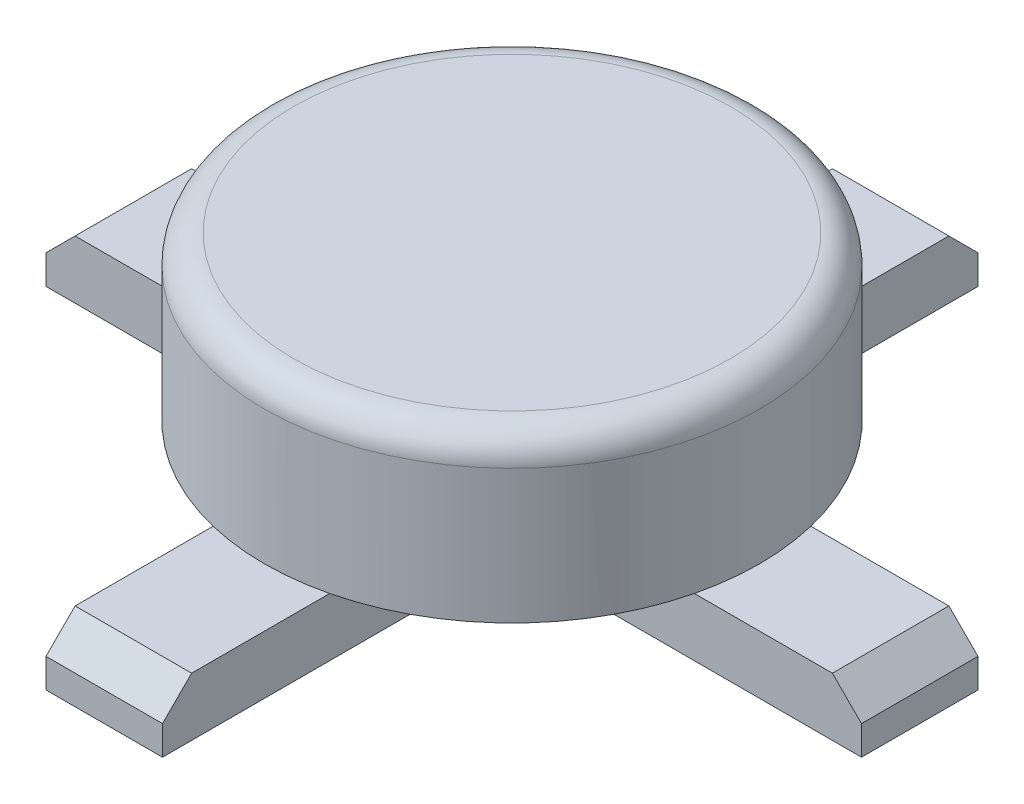
ISO-10303-21;
HEADER;
FILE_DESCRIPTION(('STEP AP214'),'2;1');
FILE_NAME('part.step','',(''),(''),'','','');
FILE_SCHEMA(('AUTOMOTIVE_DESIGN { 1 0 10303 214 1 1 1 1 }'));
ENDSEC;
DATA;
#1=APPLICATION_CONTEXT('core data for automotive mechanical design processes');
#2=APPLICATION_PROTOCOL_DEFINITION('international standard','automotive_design',2000,#1);
#3=PRODUCT_CONTEXT('',#1,'mechanical');
#4=PRODUCT('Part','Part','',(#3));
#5=PRODUCT_RELATED_PRODUCT_CATEGORY('part','',(#4));
#6=PRODUCT_DEFINITION_FORMATION('','',#4);
#7=PRODUCT_DEFINITION_CONTEXT('part definition',#1,'design');
#8=PRODUCT_DEFINITION('design','',#6,#7);
#9=PRODUCT_DEFINITION_SHAPE('','',#8);
#10=(LENGTH_UNIT() NAMED_UNIT(*) SI_UNIT(.MILLI.,.METRE.));
#11=(NAMED_UNIT(*) PLANE_ANGLE_UNIT() SI_UNIT($,.RADIAN.));
#12=(NAMED_UNIT(*) SI_UNIT($,.STERADIAN.) SOLID_ANGLE_UNIT());
#13=UNCERTAINTY_MEASURE_WITH_UNIT(LENGTH_MEASURE(1.E-05),#10,'distance_accuracy_value','');
#14=(GEOMETRIC_REPRESENTATION_CONTEXT(3) GLOBAL_UNCERTAINTY_ASSIGNED_CONTEXT((#13)) GLOBAL_UNIT_ASSIGNED_CONTEXT((#10,
#11,#12)) REPRESENTATION_CONTEXT('',''));
#15=CARTESIAN_POINT('',(0.,0.,0.));
#16=DIRECTION('',(0.,0.,1.));
#17=DIRECTION('',(1.,0.,0.));
#18=AXIS2_PLACEMENT_3D('',#15,#16,#17);
#19=CARTESIAN_POINT('',(0.,0.,0.));
#20=DIRECTION('',(0.,1.,0.));
#21=DIRECTION('',(0.,0.,1.));
#22=AXIS2_PLACEMENT_3D('',#19,#20,#21);
#23=PLANE('',#22);
#24=DIRECTION('',(0.,0.,1.));
#25=VECTOR('',#24,1.);
#26=CARTESIAN_POINT('',(0.999999999999999,0.,7.));
#27=LINE('',#26,#25);
#28=CARTESIAN_POINT('',(1.,0.,-4.13067791046458));
#29=VERTEX_POINT('',#28);
#30=CARTESIAN_POINT('',(1.,0.,-1.));
#31=VERTEX_POINT('',#30);
#32=EDGE_CURVE('E306',#29,#31,#27,.T.);
#33=ORIENTED_EDGE('',*,*,#32,.F.);
#34=CARTESIAN_POINT('',(0.,0.,0.));
#35=DIRECTION('',(0.,1.,0.));
#36=DIRECTION('',(0.,0.,1.));
#37=AXIS2_PLACEMENT_3D('',#34,#35,#36);
#38=CIRCLE('',#37,4.25);
#39=CARTESIAN_POINT('',(4.13067791046458,0.,-1.));
#40=VERTEX_POINT('',#39);
#41=EDGE_CURVE('E251',#40,#29,#38,.T.);
#42=ORIENTED_EDGE('',*,*,#41,.F.);
#43=DIRECTION('',(1.,0.,0.));
#44=VECTOR('',#43,1.);
#45=CARTESIAN_POINT('',(-7.,0.,-1.));
#46=LINE('',#45,#44);
#47=EDGE_CURVE('E233',#31,#40,#46,.T.);
#48=ORIENTED_EDGE('',*,*,#47,.F.);
#49=EDGE_LOOP('',(#33,#42,#48));
#50=FACE_BOUND('',#49,.T.);
#51=ADVANCED_FACE('F33',(#50),#23,.F.);
#52=DIRECTION('',(0.,0.,-1.));
#53=VECTOR('',#52,1.);
#54=CARTESIAN_POINT('',(-1.,0.,7.));
#55=LINE('',#54,#53);
#56=CARTESIAN_POINT('',(-1.,0.,-1.));
#57=VERTEX_POINT('',#56);
#58=CARTESIAN_POINT('',(-1.,0.,-4.13067791046458));
#59=VERTEX_POINT('',#58);
#60=EDGE_CURVE('E396',#57,#59,#55,.T.);
#61=ORIENTED_EDGE('',*,*,#60,.F.);
#62=CARTESIAN_POINT('',(-4.13067791046458,0.,-1.));
#63=VERTEX_POINT('',#62);
#64=EDGE_CURVE('E234',#63,#57,#46,.T.);
#65=ORIENTED_EDGE('',*,*,#64,.F.);
#66=EDGE_CURVE('E403',#59,#63,#38,.T.);
#67=ORIENTED_EDGE('',*,*,#66,.F.);
#68=EDGE_LOOP('',(#61,#65,#67));
#69=FACE_BOUND('',#68,.T.);
#70=ADVANCED_FACE('F373',(#69),#23,.F.);
#71=CARTESIAN_POINT('',(1.,0.,0.999999999999999));
#72=VERTEX_POINT('',#71);
#73=CARTESIAN_POINT('',(0.999999999999999,0.,4.13067791046458));
#74=VERTEX_POINT('',#73);
#75=EDGE_CURVE('E330',#72,#74,#27,.T.);
#76=ORIENTED_EDGE('',*,*,#75,.F.);
#77=DIRECTION('',(-1.,0.,0.));
#78=VECTOR('',#77,1.);
#79=CARTESIAN_POINT('',(-7.,0.,1.));
#80=LINE('',#79,#78);
#81=CARTESIAN_POINT('',(4.13067791046458,0.,1.));
#82=VERTEX_POINT('',#81);
#83=EDGE_CURVE('E231',#82,#72,#80,.T.);
#84=ORIENTED_EDGE('',*,*,#83,.F.);
#85=EDGE_CURVE('E246',#74,#82,#38,.T.);
#86=ORIENTED_EDGE('',*,*,#85,.F.);
#87=EDGE_LOOP('',(#76,#84,#86));
#88=FACE_BOUND('',#87,.T.);
#89=ADVANCED_FACE('F333',(#88),#23,.F.);
#90=CARTESIAN_POINT('',(-1.,0.,4.13067791046458));
#91=VERTEX_POINT('',#90);
#92=CARTESIAN_POINT('',(-1.,0.,0.999999999999999));
#93=VERTEX_POINT('',#92);
#94=EDGE_CURVE('E303',#91,#93,#55,.T.);
#95=ORIENTED_EDGE('',*,*,#94,.F.);
#96=CARTESIAN_POINT('',(-4.13067791046458,0.,1.));
#97=VERTEX_POINT('',#96);
#98=EDGE_CURVE('E394',#97,#91,#38,.T.);
#99=ORIENTED_EDGE('',*,*,#98,.F.);
#100=EDGE_CURVE('E230',#93,#97,#80,.T.);
#101=ORIENTED_EDGE('',*,*,#100,.F.);
#102=EDGE_LOOP('',(#95,#99,#101));
#103=FACE_BOUND('',#102,.T.);
#104=ADVANCED_FACE('F376',(#103),#23,.F.);
#105=CARTESIAN_POINT('',(-7.,-1.,1.));
#106=DIRECTION('',(0.,0.,-1.));
#107=DIRECTION('',(-1.,0.,0.));
#108=AXIS2_PLACEMENT_3D('',#105,#106,#107);
#109=PLANE('',#108);
#110=DIRECTION('',(0.,1.,0.));
#111=VECTOR('',#110,1.);
#112=CARTESIAN_POINT('',(7.,-1.,1.));
#113=LINE('',#112,#111);
#114=CARTESIAN_POINT('',(7.,-1.,1.));
#115=VERTEX_POINT('',#114);
#116=CARTESIAN_POINT('',(7.,-0.500000000000002,1.));
#117=VERTEX_POINT('',#116);
#118=EDGE_CURVE('E243',#115,#117,#113,.T.);
#119=ORIENTED_EDGE('',*,*,#118,.T.);
#120=DIRECTION('',(0.70710678118655,-0.707106781186545,0.));
#121=VECTOR('',#120,1.);
#122=CARTESIAN_POINT('',(7.,-0.500000000000002,1.));
#123=LINE('',#122,#121);
#124=CARTESIAN_POINT('',(6.5,0.,1.));
#125=VERTEX_POINT('',#124);
#126=EDGE_CURVE('E267',#117,#125,#123,.F.);
#127=ORIENTED_EDGE('',*,*,#126,.T.);
#128=EDGE_CURVE('E226',#125,#82,#80,.T.);
#129=ORIENTED_EDGE('',*,*,#128,.T.);
#130=ORIENTED_EDGE('',*,*,#83,.T.);
#131=DIRECTION('',(0.,1.,0.));
#132=VECTOR('',#131,1.);
#133=CARTESIAN_POINT('',(0.999999999999999,-1.,1.));
#134=LINE('',#133,#132);
#135=CARTESIAN_POINT('',(1.,-1.,0.999999999999999));
#136=VERTEX_POINT('',#135);
#137=EDGE_CURVE('E209',#136,#72,#134,.T.);
#138=ORIENTED_EDGE('',*,*,#137,.F.);
#139=DIRECTION('',(-1.,0.,0.));
#140=VECTOR('',#139,1.);
#141=CARTESIAN_POINT('',(-7.,-1.,1.));
#142=LINE('',#141,#140);
#143=EDGE_CURVE('E174',#115,#136,#142,.T.);
#144=ORIENTED_EDGE('',*,*,#143,.F.);
#145=EDGE_LOOP('',(#119,#127,#129,#130,#138,#144));
#146=FACE_BOUND('',#145,.T.);
#147=ADVANCED_FACE('F324',(#146),#109,.F.);
#148=CARTESIAN_POINT('',(-6.49999999999999,0.,1.));
#149=VERTEX_POINT('',#148);
#150=EDGE_CURVE('E229',#97,#149,#80,.T.);
#151=ORIENTED_EDGE('',*,*,#150,.T.);
#152=DIRECTION('',(0.70710678118655,0.707106781186545,0.));
#153=VECTOR('',#152,1.);
#154=CARTESIAN_POINT('',(-7.,-0.500000000000002,1.));
#155=LINE('',#154,#153);
#156=CARTESIAN_POINT('',(-7.,-0.500000000000002,1.));
#157=VERTEX_POINT('',#156);
#158=EDGE_CURVE('E280',#149,#157,#155,.F.);
#159=ORIENTED_EDGE('',*,*,#158,.T.);
#160=DIRECTION('',(0.,1.,0.));
#161=VECTOR('',#160,1.);
#162=CARTESIAN_POINT('',(-7.,-1.,1.));
#163=LINE('',#162,#161);
#164=CARTESIAN_POINT('',(-7.,-1.,1.));
#165=VERTEX_POINT('',#164);
#166=EDGE_CURVE('E240',#165,#157,#163,.T.);
#167=ORIENTED_EDGE('',*,*,#166,.F.);
#168=CARTESIAN_POINT('',(-1.,-1.,1.));
#169=VERTEX_POINT('',#168);
#170=EDGE_CURVE('E217',#169,#165,#142,.T.);
#171=ORIENTED_EDGE('',*,*,#170,.F.);
#172=DIRECTION('',(0.,-1.,0.));
#173=VECTOR('',#172,1.);
#174=CARTESIAN_POINT('',(-1.,-1.,1.));
#175=LINE('',#174,#173);
#176=EDGE_CURVE('E198',#93,#169,#175,.T.);
#177=ORIENTED_EDGE('',*,*,#176,.F.);
#178=ORIENTED_EDGE('',*,*,#100,.T.);
#179=EDGE_LOOP('',(#151,#159,#167,#171,#177,#178));
#180=FACE_BOUND('',#179,.T.);
#181=ADVANCED_FACE('F352',(#180),#109,.F.);
#182=CARTESIAN_POINT('',(-7.,-1.,-1.));
#183=DIRECTION('',(0.,0.,1.));
#184=DIRECTION('',(1.,0.,0.));
#185=AXIS2_PLACEMENT_3D('',#182,#183,#184);
#186=PLANE('',#185);
#187=CARTESIAN_POINT('',(6.5,0.,-1.));
#188=VERTEX_POINT('',#187);
#189=EDGE_CURVE('E228',#40,#188,#46,.T.);
#190=ORIENTED_EDGE('',*,*,#189,.T.);
#191=DIRECTION('',(-0.70710678118655,0.707106781186545,0.));
#192=VECTOR('',#191,1.);
#193=CARTESIAN_POINT('',(7.,-0.500000000000002,-1.));
#194=LINE('',#193,#192);
#195=CARTESIAN_POINT('',(7.,-0.500000000000002,-1.));
#196=VERTEX_POINT('',#195);
#197=EDGE_CURVE('E271',#188,#196,#194,.F.);
#198=ORIENTED_EDGE('',*,*,#197,.T.);
#199=DIRECTION('',(0.,1.,0.));
#200=VECTOR('',#199,1.);
#201=CARTESIAN_POINT('',(7.,-1.,-1.));
#202=LINE('',#201,#200);
#203=CARTESIAN_POINT('',(7.,-1.,-1.));
#204=VERTEX_POINT('',#203);
#205=EDGE_CURVE('E225',#204,#196,#202,.T.);
#206=ORIENTED_EDGE('',*,*,#205,.F.);
#207=DIRECTION('',(1.,0.,0.));
#208=VECTOR('',#207,1.);
#209=CARTESIAN_POINT('',(-7.,-1.,-1.));
#210=LINE('',#209,#208);
#211=CARTESIAN_POINT('',(0.999999999999999,-1.,-1.));
#212=VERTEX_POINT('',#211);
#213=EDGE_CURVE('E222',#212,#204,#210,.T.);
#214=ORIENTED_EDGE('',*,*,#213,.F.);
#215=DIRECTION('',(0.,-1.,0.));
#216=VECTOR('',#215,1.);
#217=CARTESIAN_POINT('',(1.,-1.,-1.));
#218=LINE('',#217,#216);
#219=EDGE_CURVE('E206',#31,#212,#218,.T.);
#220=ORIENTED_EDGE('',*,*,#219,.F.);
#221=ORIENTED_EDGE('',*,*,#47,.T.);
#222=EDGE_LOOP('',(#190,#198,#206,#214,#220,#221));
#223=FACE_BOUND('',#222,.T.);
#224=ADVANCED_FACE('F316',(#223),#186,.F.);
#225=DIRECTION('',(0.,1.,0.));
#226=VECTOR('',#225,1.);
#227=CARTESIAN_POINT('',(-7.,-1.,-1.));
#228=LINE('',#227,#226);
#229=CARTESIAN_POINT('',(-7.,-1.,-1.));
#230=VERTEX_POINT('',#229);
#231=CARTESIAN_POINT('',(-7.,-0.500000000000002,-1.));
#232=VERTEX_POINT('',#231);
#233=EDGE_CURVE('E237',#230,#232,#228,.T.);
#234=ORIENTED_EDGE('',*,*,#233,.T.);
#235=DIRECTION('',(-0.70710678118655,-0.707106781186545,0.));
#236=VECTOR('',#235,1.);
#237=CARTESIAN_POINT('',(-7.,-0.500000000000002,-1.));
#238=LINE('',#237,#236);
#239=CARTESIAN_POINT('',(-6.49999999999999,0.,-1.));
#240=VERTEX_POINT('',#239);
#241=EDGE_CURVE('E276',#232,#240,#238,.F.);
#242=ORIENTED_EDGE('',*,*,#241,.T.);
#243=EDGE_CURVE('E218',#240,#63,#46,.T.);
#244=ORIENTED_EDGE('',*,*,#243,.T.);
#245=ORIENTED_EDGE('',*,*,#64,.T.);
#246=DIRECTION('',(0.,1.,0.));
#247=VECTOR('',#246,1.);
#248=CARTESIAN_POINT('',(-1.,-1.,-1.));
#249=LINE('',#248,#247);
#250=CARTESIAN_POINT('',(-1.,-1.,-1.));
#251=VERTEX_POINT('',#250);
#252=EDGE_CURVE('E196',#251,#57,#249,.T.);
#253=ORIENTED_EDGE('',*,*,#252,.F.);
#254=EDGE_CURVE('E223',#230,#251,#210,.T.);
#255=ORIENTED_EDGE('',*,*,#254,.F.);
#256=EDGE_LOOP('',(#234,#242,#244,#245,#253,#255));
#257=FACE_BOUND('',#256,.T.);
#258=ADVANCED_FACE('F360',(#257),#186,.F.);
#259=CARTESIAN_POINT('',(0.,2.8,0.));
#260=DIRECTION('',(0.,-1.,0.));
#261=DIRECTION('',(0.,0.,-1.));
#262=AXIS2_PLACEMENT_3D('',#259,#260,#261);
#263=CYLINDRICAL_SURFACE('',#262,4.25);
#264=CARTESIAN_POINT('',(0.,2.3,0.));
#265=DIRECTION('',(0.,1.,0.));
#266=DIRECTION('',(0.,0.,1.));
#267=AXIS2_PLACEMENT_3D('',#264,#265,#266);
#268=CIRCLE('',#267,4.25);
#269=CARTESIAN_POINT('',(0.,2.3,4.25));
#270=VERTEX_POINT('',#269);
#271=EDGE_CURVE('E254',#270,#270,#268,.F.);
#272=ORIENTED_EDGE('',*,*,#271,.T.);
#273=EDGE_LOOP('',(#272));
#274=FACE_BOUND('',#273,.T.);
#275=EDGE_CURVE('E247',#82,#40,#38,.T.);
#276=ORIENTED_EDGE('',*,*,#275,.T.);
#277=ORIENTED_EDGE('',*,*,#41,.T.);
#278=CARTESIAN_POINT('',(0.,0.,0.));
#279=DIRECTION('',(0.,-1.,0.));
#280=DIRECTION('',(0.,0.,-1.));
#281=AXIS2_PLACEMENT_3D('',#278,#279,#280);
#282=CIRCLE('',#281,4.25);
#283=EDGE_CURVE('E211',#59,#29,#282,.T.);
#284=ORIENTED_EDGE('',*,*,#283,.F.);
#285=ORIENTED_EDGE('',*,*,#66,.T.);
#286=EDGE_CURVE('E402',#63,#97,#38,.T.);
#287=ORIENTED_EDGE('',*,*,#286,.T.);
#288=ORIENTED_EDGE('',*,*,#98,.T.);
#289=EDGE_CURVE('E214',#74,#91,#282,.T.);
#290=ORIENTED_EDGE('',*,*,#289,.F.);
#291=ORIENTED_EDGE('',*,*,#85,.T.);
#292=EDGE_LOOP('',(#276,#277,#284,#285,#287,#288,#290,#291));
#293=FACE_BOUND('',#292,.T.);
#294=ADVANCED_FACE('F399',(#274,#293),#263,.T.);
#295=CARTESIAN_POINT('',(0.,2.8,0.));
#296=DIRECTION('',(0.,1.,0.));
#297=DIRECTION('',(0.,0.,1.));
#298=AXIS2_PLACEMENT_3D('',#295,#296,#297);
#299=PLANE('',#298);
#300=CARTESIAN_POINT('',(0.,2.8,0.));
#301=DIRECTION('',(0.,1.,0.));
#302=DIRECTION('',(0.,0.,1.));
#303=AXIS2_PLACEMENT_3D('',#300,#301,#302);
#304=CIRCLE('',#303,3.75);
#305=CARTESIAN_POINT('',(0.,2.8,3.75));
#306=VERTEX_POINT('',#305);
#307=EDGE_CURVE('E250',#306,#306,#304,.T.);
#308=ORIENTED_EDGE('',*,*,#307,.T.);
#309=EDGE_LOOP('',(#308));
#310=FACE_BOUND('',#309,.T.);
#311=ADVANCED_FACE('F423',(#310),#299,.T.);
#312=CARTESIAN_POINT('',(0.,2.3,0.));
#313=DIRECTION('',(0.,1.,0.));
#314=DIRECTION('',(0.,0.,1.));
#315=AXIS2_PLACEMENT_3D('',#312,#313,#314);
#316=TOROIDAL_SURFACE('',#315,3.75,0.5);
#317=ORIENTED_EDGE('',*,*,#271,.F.);
#318=EDGE_LOOP('',(#317));
#319=FACE_BOUND('',#318,.T.);
#320=ORIENTED_EDGE('',*,*,#307,.F.);
#321=EDGE_LOOP('',(#320));
#322=FACE_BOUND('',#321,.T.);
#323=ADVANCED_FACE('F415',(#319,#322),#316,.T.);
#324=CARTESIAN_POINT('',(0.,0.,0.));
#325=DIRECTION('',(0.,-1.,0.));
#326=DIRECTION('',(0.,0.,-1.));
#327=AXIS2_PLACEMENT_3D('',#324,#325,#326);
#328=PLANE('',#327);
#329=ORIENTED_EDGE('',*,*,#128,.F.);
#330=DIRECTION('',(0.,0.,-1.));
#331=VECTOR('',#330,1.);
#332=CARTESIAN_POINT('',(6.5,0.,0.));
#333=LINE('',#332,#331);
#334=EDGE_CURVE('E269',#125,#188,#333,.T.);
#335=ORIENTED_EDGE('',*,*,#334,.T.);
#336=ORIENTED_EDGE('',*,*,#189,.F.);
#337=ORIENTED_EDGE('',*,*,#275,.F.);
#338=EDGE_LOOP('',(#329,#335,#336,#337));
#339=FACE_BOUND('',#338,.T.);
#340=ADVANCED_FACE('F413',(#339),#328,.F.);
#341=CARTESIAN_POINT('',(7.,-1.,1.));
#342=DIRECTION('',(-1.,0.,0.));
#343=DIRECTION('',(0.,0.,1.));
#344=AXIS2_PLACEMENT_3D('',#341,#342,#343);
#345=PLANE('',#344);
#346=ORIENTED_EDGE('',*,*,#205,.T.);
#347=DIRECTION('',(0.,0.,1.));
#348=VECTOR('',#347,1.);
#349=CARTESIAN_POINT('',(7.,-0.500000000000002,1.));
#350=LINE('',#349,#348);
#351=EDGE_CURVE('E264',#196,#117,#350,.T.);
#352=ORIENTED_EDGE('',*,*,#351,.T.);
#353=ORIENTED_EDGE('',*,*,#118,.F.);
#354=DIRECTION('',(0.,0.,1.));
#355=VECTOR('',#354,1.);
#356=CARTESIAN_POINT('',(7.,-1.,1.));
#357=LINE('',#356,#355);
#358=EDGE_CURVE('E215',#204,#115,#357,.T.);
#359=ORIENTED_EDGE('',*,*,#358,.F.);
#360=EDGE_LOOP('',(#346,#352,#353,#359));
#361=FACE_BOUND('',#360,.T.);
#362=ADVANCED_FACE('F322',(#361),#345,.F.);
#363=CARTESIAN_POINT('',(-7.,-1.,1.));
#364=DIRECTION('',(1.,0.,0.));
#365=DIRECTION('',(0.,0.,-1.));
#366=AXIS2_PLACEMENT_3D('',#363,#364,#365);
#367=PLANE('',#366);
#368=ORIENTED_EDGE('',*,*,#166,.T.);
#369=DIRECTION('',(0.,0.,-1.));
#370=VECTOR('',#369,1.);
#371=CARTESIAN_POINT('',(-7.,-0.500000000000002,1.));
#372=LINE('',#371,#370);
#373=EDGE_CURVE('E273',#157,#232,#372,.T.);
#374=ORIENTED_EDGE('',*,*,#373,.T.);
#375=ORIENTED_EDGE('',*,*,#233,.F.);
#376=DIRECTION('',(0.,0.,-1.));
#377=VECTOR('',#376,1.);
#378=CARTESIAN_POINT('',(-7.,-1.,1.));
#379=LINE('',#378,#377);
#380=EDGE_CURVE('E220',#165,#230,#379,.T.);
#381=ORIENTED_EDGE('',*,*,#380,.F.);
#382=EDGE_LOOP('',(#368,#374,#375,#381));
#383=FACE_BOUND('',#382,.T.);
#384=ADVANCED_FACE('F356',(#383),#367,.F.);
#385=CARTESIAN_POINT('',(0.,-1.,0.));
#386=DIRECTION('',(0.,-1.,0.));
#387=DIRECTION('',(0.,0.,-1.));
#388=AXIS2_PLACEMENT_3D('',#385,#386,#387);
#389=PLANE('',#388);
#390=ORIENTED_EDGE('',*,*,#254,.T.);
#391=DIRECTION('',(0.,0.,-1.));
#392=VECTOR('',#391,1.);
#393=CARTESIAN_POINT('',(-1.,-1.,7.));
#394=LINE('',#393,#392);
#395=CARTESIAN_POINT('',(-0.999999999999999,-1.,-7.));
#396=VERTEX_POINT('',#395);
#397=EDGE_CURVE('E190',#251,#396,#394,.T.);
#398=ORIENTED_EDGE('',*,*,#397,.T.);
#399=DIRECTION('',(1.,0.,0.));
#400=VECTOR('',#399,1.);
#401=CARTESIAN_POINT('',(-0.999999999999999,-1.,-7.));
#402=LINE('',#401,#400);
#403=CARTESIAN_POINT('',(1.,-1.,-7.));
#404=VERTEX_POINT('',#403);
#405=EDGE_CURVE('E297',#396,#404,#402,.T.);
#406=ORIENTED_EDGE('',*,*,#405,.T.);
#407=DIRECTION('',(0.,0.,1.));
#408=VECTOR('',#407,1.);
#409=CARTESIAN_POINT('',(0.999999999999999,-1.,7.));
#410=LINE('',#409,#408);
#411=EDGE_CURVE('E178',#404,#212,#410,.T.);
#412=ORIENTED_EDGE('',*,*,#411,.T.);
#413=ORIENTED_EDGE('',*,*,#213,.T.);
#414=ORIENTED_EDGE('',*,*,#358,.T.);
#415=ORIENTED_EDGE('',*,*,#143,.T.);
#416=CARTESIAN_POINT('',(0.999999999999999,-1.,7.));
#417=VERTEX_POINT('',#416);
#418=EDGE_CURVE('E167',#136,#417,#410,.T.);
#419=ORIENTED_EDGE('',*,*,#418,.T.);
#420=DIRECTION('',(-1.,0.,0.));
#421=VECTOR('',#420,1.);
#422=CARTESIAN_POINT('',(-1.,-1.,7.));
#423=LINE('',#422,#421);
#424=CARTESIAN_POINT('',(-1.,-1.,7.));
#425=VERTEX_POINT('',#424);
#426=EDGE_CURVE('E171',#417,#425,#423,.T.);
#427=ORIENTED_EDGE('',*,*,#426,.T.);
#428=EDGE_CURVE('E299',#425,#169,#394,.T.);
#429=ORIENTED_EDGE('',*,*,#428,.T.);
#430=ORIENTED_EDGE('',*,*,#170,.T.);
#431=ORIENTED_EDGE('',*,*,#380,.T.);
#432=EDGE_LOOP('',(#390,#398,#406,#412,#413,#414,#415,#419,#427,#429,#430,#431));
#433=FACE_BOUND('',#432,.T.);
#434=ADVANCED_FACE('F170',(#433),#389,.T.);
#435=ORIENTED_EDGE('',*,*,#243,.F.);
#436=DIRECTION('',(0.,0.,1.));
#437=VECTOR('',#436,1.);
#438=CARTESIAN_POINT('',(-6.49999999999999,0.,0.));
#439=LINE('',#438,#437);
#440=EDGE_CURVE('E278',#240,#149,#439,.T.);
#441=ORIENTED_EDGE('',*,*,#440,.T.);
#442=ORIENTED_EDGE('',*,*,#150,.F.);
#443=ORIENTED_EDGE('',*,*,#286,.F.);
#444=EDGE_LOOP('',(#435,#441,#442,#443));
#445=FACE_BOUND('',#444,.T.);
#446=ADVANCED_FACE('F417',(#445),#328,.F.);
#447=CARTESIAN_POINT('',(-0.999999999999999,-1.,-7.));
#448=DIRECTION('',(0.,0.,1.));
#449=DIRECTION('',(1.,0.,0.));
#450=AXIS2_PLACEMENT_3D('',#447,#448,#449);
#451=PLANE('',#450);
#452=DIRECTION('',(0.,1.,0.));
#453=VECTOR('',#452,1.);
#454=CARTESIAN_POINT('',(-0.999999999999999,-1.,-7.));
#455=LINE('',#454,#453);
#456=CARTESIAN_POINT('',(-0.999999999999999,-0.500000000000002,-7.));
#457=VERTEX_POINT('',#456);
#458=EDGE_CURVE('E200',#396,#457,#455,.T.);
#459=ORIENTED_EDGE('',*,*,#458,.T.);
#460=DIRECTION('',(1.,0.,0.));
#461=VECTOR('',#460,1.);
#462=CARTESIAN_POINT('',(-0.999999999999999,-0.500000000000002,-7.));
#463=LINE('',#462,#461);
#464=CARTESIAN_POINT('',(1.,-0.500000000000002,-7.));
#465=VERTEX_POINT('',#464);
#466=EDGE_CURVE('E282',#457,#465,#463,.T.);
#467=ORIENTED_EDGE('',*,*,#466,.T.);
#468=DIRECTION('',(0.,1.,0.));
#469=VECTOR('',#468,1.);
#470=CARTESIAN_POINT('',(1.,-1.,-7.));
#471=LINE('',#470,#469);
#472=EDGE_CURVE('E291',#404,#465,#471,.T.);
#473=ORIENTED_EDGE('',*,*,#472,.F.);
#474=ORIENTED_EDGE('',*,*,#405,.F.);
#475=EDGE_LOOP('',(#459,#467,#473,#474));
#476=FACE_BOUND('',#475,.T.);
#477=ADVANCED_FACE('F289',(#476),#451,.F.);
#478=CARTESIAN_POINT('',(-1.,-1.,7.));
#479=DIRECTION('',(1.,0.,0.));
#480=DIRECTION('',(0.,0.,-1.));
#481=AXIS2_PLACEMENT_3D('',#478,#479,#480);
#482=PLANE('',#481);
#483=CARTESIAN_POINT('',(-0.999999999999999,0.,-6.5));
#484=VERTEX_POINT('',#483);
#485=EDGE_CURVE('E304',#59,#484,#55,.T.);
#486=ORIENTED_EDGE('',*,*,#485,.T.);
#487=DIRECTION('',(0.,0.707106781186545,0.70710678118655));
#488=VECTOR('',#487,1.);
#489=CARTESIAN_POINT('',(-0.999999999999999,-0.500000000000002,-7.));
#490=LINE('',#489,#488);
#491=EDGE_CURVE('E11',#484,#457,#490,.F.);
#492=ORIENTED_EDGE('',*,*,#491,.T.);
#493=ORIENTED_EDGE('',*,*,#458,.F.);
#494=ORIENTED_EDGE('',*,*,#397,.F.);
#495=ORIENTED_EDGE('',*,*,#252,.T.);
#496=ORIENTED_EDGE('',*,*,#60,.T.);
#497=EDGE_LOOP('',(#486,#492,#493,#494,#495,#496));
#498=FACE_BOUND('',#497,.T.);
#499=ADVANCED_FACE('F363',(#498),#482,.F.);
#500=CARTESIAN_POINT('',(0.999999999999999,-1.,7.));
#501=DIRECTION('',(-1.,0.,0.));
#502=DIRECTION('',(0.,0.,1.));
#503=AXIS2_PLACEMENT_3D('',#500,#501,#502);
#504=PLANE('',#503);
#505=ORIENTED_EDGE('',*,*,#472,.T.);
#506=DIRECTION('',(0.,-0.707106781186545,-0.70710678118655));
#507=VECTOR('',#506,1.);
#508=CARTESIAN_POINT('',(1.,-0.500000000000002,-7.));
#509=LINE('',#508,#507);
#510=CARTESIAN_POINT('',(1.,0.,-6.5));
#511=VERTEX_POINT('',#510);
#512=EDGE_CURVE('E55',#465,#511,#509,.F.);
#513=ORIENTED_EDGE('',*,*,#512,.T.);
#514=EDGE_CURVE('E305',#511,#29,#27,.T.);
#515=ORIENTED_EDGE('',*,*,#514,.T.);
#516=ORIENTED_EDGE('',*,*,#32,.T.);
#517=ORIENTED_EDGE('',*,*,#219,.T.);
#518=ORIENTED_EDGE('',*,*,#411,.F.);
#519=EDGE_LOOP('',(#505,#513,#515,#516,#517,#518));
#520=FACE_BOUND('',#519,.T.);
#521=ADVANCED_FACE('F296',(#520),#504,.F.);
#522=CARTESIAN_POINT('',(0.,0.,0.));
#523=DIRECTION('',(0.,-1.,0.));
#524=DIRECTION('',(0.,0.,-1.));
#525=AXIS2_PLACEMENT_3D('',#522,#523,#524);
#526=PLANE('',#525);
#527=ORIENTED_EDGE('',*,*,#514,.F.);
#528=DIRECTION('',(-1.,0.,0.));
#529=VECTOR('',#528,1.);
#530=CARTESIAN_POINT('',(0.,0.,-6.5));
#531=LINE('',#530,#529);
#532=EDGE_CURVE('E41',#511,#484,#531,.T.);
#533=ORIENTED_EDGE('',*,*,#532,.T.);
#534=ORIENTED_EDGE('',*,*,#485,.F.);
#535=ORIENTED_EDGE('',*,*,#283,.T.);
#536=EDGE_LOOP('',(#527,#533,#534,#535));
#537=FACE_BOUND('',#536,.T.);
#538=ADVANCED_FACE('F441',(#537),#526,.F.);
#539=CARTESIAN_POINT('',(-1.,0.,6.49999999999999));
#540=VERTEX_POINT('',#539);
#541=EDGE_CURVE('E179',#540,#91,#55,.T.);
#542=ORIENTED_EDGE('',*,*,#541,.F.);
#543=DIRECTION('',(1.,0.,0.));
#544=VECTOR('',#543,1.);
#545=CARTESIAN_POINT('',(0.,0.,6.49999999999999));
#546=LINE('',#545,#544);
#547=CARTESIAN_POINT('',(0.999999999999999,0.,6.49999999999999));
#548=VERTEX_POINT('',#547);
#549=EDGE_CURVE('E261',#540,#548,#546,.T.);
#550=ORIENTED_EDGE('',*,*,#549,.T.);
#551=EDGE_CURVE('E307',#74,#548,#27,.T.);
#552=ORIENTED_EDGE('',*,*,#551,.F.);
#553=ORIENTED_EDGE('',*,*,#289,.T.);
#554=EDGE_LOOP('',(#542,#550,#552,#553));
#555=FACE_BOUND('',#554,.T.);
#556=ADVANCED_FACE('F439',(#555),#526,.F.);
#557=ORIENTED_EDGE('',*,*,#551,.T.);
#558=DIRECTION('',(0.,0.707106781186545,-0.70710678118655));
#559=VECTOR('',#558,1.);
#560=CARTESIAN_POINT('',(0.999999999999999,-0.500000000000002,7.));
#561=LINE('',#560,#559);
#562=CARTESIAN_POINT('',(0.999999999999999,-0.500000000000002,7.));
#563=VERTEX_POINT('',#562);
#564=EDGE_CURVE('E195',#548,#563,#561,.F.);
#565=ORIENTED_EDGE('',*,*,#564,.T.);
#566=DIRECTION('',(0.,1.,0.));
#567=VECTOR('',#566,1.);
#568=CARTESIAN_POINT('',(0.999999999999999,-1.,7.));
#569=LINE('',#568,#567);
#570=EDGE_CURVE('E185',#417,#563,#569,.T.);
#571=ORIENTED_EDGE('',*,*,#570,.F.);
#572=ORIENTED_EDGE('',*,*,#418,.F.);
#573=ORIENTED_EDGE('',*,*,#137,.T.);
#574=ORIENTED_EDGE('',*,*,#75,.T.);
#575=EDGE_LOOP('',(#557,#565,#571,#572,#573,#574));
#576=FACE_BOUND('',#575,.T.);
#577=ADVANCED_FACE('F193',(#576),#504,.F.);
#578=DIRECTION('',(0.,1.,0.));
#579=VECTOR('',#578,1.);
#580=CARTESIAN_POINT('',(-1.,-1.,7.));
#581=LINE('',#580,#579);
#582=CARTESIAN_POINT('',(-1.,-0.500000000000002,7.));
#583=VERTEX_POINT('',#582);
#584=EDGE_CURVE('E188',#425,#583,#581,.T.);
#585=ORIENTED_EDGE('',*,*,#584,.T.);
#586=DIRECTION('',(0.,-0.707106781186545,0.70710678118655));
#587=VECTOR('',#586,1.);
#588=CARTESIAN_POINT('',(-1.,-0.500000000000002,7.));
#589=LINE('',#588,#587);
#590=EDGE_CURVE('E259',#583,#540,#589,.F.);
#591=ORIENTED_EDGE('',*,*,#590,.T.);
#592=ORIENTED_EDGE('',*,*,#541,.T.);
#593=ORIENTED_EDGE('',*,*,#94,.T.);
#594=ORIENTED_EDGE('',*,*,#176,.T.);
#595=ORIENTED_EDGE('',*,*,#428,.F.);
#596=EDGE_LOOP('',(#585,#591,#592,#593,#594,#595));
#597=FACE_BOUND('',#596,.T.);
#598=ADVANCED_FACE('F343',(#597),#482,.F.);
#599=CARTESIAN_POINT('',(-1.,-1.,7.));
#600=DIRECTION('',(0.,0.,-1.));
#601=DIRECTION('',(-1.,0.,0.));
#602=AXIS2_PLACEMENT_3D('',#599,#600,#601);
#603=PLANE('',#602);
#604=ORIENTED_EDGE('',*,*,#570,.T.);
#605=DIRECTION('',(-1.,0.,0.));
#606=VECTOR('',#605,1.);
#607=CARTESIAN_POINT('',(-1.,-0.500000000000002,7.));
#608=LINE('',#607,#606);
#609=EDGE_CURVE('E257',#563,#583,#608,.T.);
#610=ORIENTED_EDGE('',*,*,#609,.T.);
#611=ORIENTED_EDGE('',*,*,#584,.F.);
#612=ORIENTED_EDGE('',*,*,#426,.F.);
#613=EDGE_LOOP('',(#604,#610,#611,#612));
#614=FACE_BOUND('',#613,.T.);
#615=ADVANCED_FACE('F183',(#614),#603,.F.);
#616=CARTESIAN_POINT('',(-1.,-0.500000000000002,7.));
#617=DIRECTION('',(0.,-0.70710678118655,-0.707106781186545));
#618=DIRECTION('',(-1.,0.,0.));
#619=AXIS2_PLACEMENT_3D('',#616,#617,#618);
#620=PLANE('',#619);
#621=ORIENTED_EDGE('',*,*,#564,.F.);
#622=ORIENTED_EDGE('',*,*,#549,.F.);
#623=ORIENTED_EDGE('',*,*,#590,.F.);
#624=ORIENTED_EDGE('',*,*,#609,.F.);
#625=EDGE_LOOP('',(#621,#622,#623,#624));
#626=FACE_BOUND('',#625,.T.);
#627=ADVANCED_FACE('F341',(#626),#620,.F.);
#628=CARTESIAN_POINT('',(7.,-0.500000000000002,1.));
#629=DIRECTION('',(-0.707106781186545,-0.70710678118655,0.));
#630=DIRECTION('',(0.,0.,1.));
#631=AXIS2_PLACEMENT_3D('',#628,#629,#630);
#632=PLANE('',#631);
#633=ORIENTED_EDGE('',*,*,#197,.F.);
#634=ORIENTED_EDGE('',*,*,#334,.F.);
#635=ORIENTED_EDGE('',*,*,#126,.F.);
#636=ORIENTED_EDGE('',*,*,#351,.F.);
#637=EDGE_LOOP('',(#633,#634,#635,#636));
#638=FACE_BOUND('',#637,.T.);
#639=ADVANCED_FACE('F370',(#638),#632,.F.);
#640=CARTESIAN_POINT('',(-7.,-0.500000000000002,1.));
#641=DIRECTION('',(0.707106781186545,-0.70710678118655,0.));
#642=DIRECTION('',(0.,0.,-1.));
#643=AXIS2_PLACEMENT_3D('',#640,#641,#642);
#644=PLANE('',#643);
#645=ORIENTED_EDGE('',*,*,#158,.F.);
#646=ORIENTED_EDGE('',*,*,#440,.F.);
#647=ORIENTED_EDGE('',*,*,#241,.F.);
#648=ORIENTED_EDGE('',*,*,#373,.F.);
#649=EDGE_LOOP('',(#645,#646,#647,#648));
#650=FACE_BOUND('',#649,.T.);
#651=ADVANCED_FACE('F366',(#650),#644,.F.);
#652=CARTESIAN_POINT('',(-0.999999999999999,-0.500000000000002,-7.));
#653=DIRECTION('',(0.,-0.70710678118655,0.707106781186545));
#654=DIRECTION('',(1.,0.,0.));
#655=AXIS2_PLACEMENT_3D('',#652,#653,#654);
#656=PLANE('',#655);
#657=ORIENTED_EDGE('',*,*,#491,.F.);
#658=ORIENTED_EDGE('',*,*,#532,.F.);
#659=ORIENTED_EDGE('',*,*,#512,.F.);
#660=ORIENTED_EDGE('',*,*,#466,.F.);
#661=EDGE_LOOP('',(#657,#658,#659,#660));
#662=FACE_BOUND('',#661,.T.);
#663=ADVANCED_FACE('F35',(#662),#656,.F.);
#664=CLOSED_SHELL('',(#51,#70,#89,#104,#147,#181,#224,#258,#294,#311,#323,#340,#362,#384,#434,
#446,#477,#499,#521,#538,#556,#577,#598,#615,#627,#639,#651,#663));
#665=MANIFOLD_SOLID_BREP('B2',#664);
#666=ADVANCED_BREP_SHAPE_REPRESENTATION('',(#18,#665),#14);
#667=SHAPE_DEFINITION_REPRESENTATION(#9,#666);
ENDSEC;
END-ISO-10303-21;
